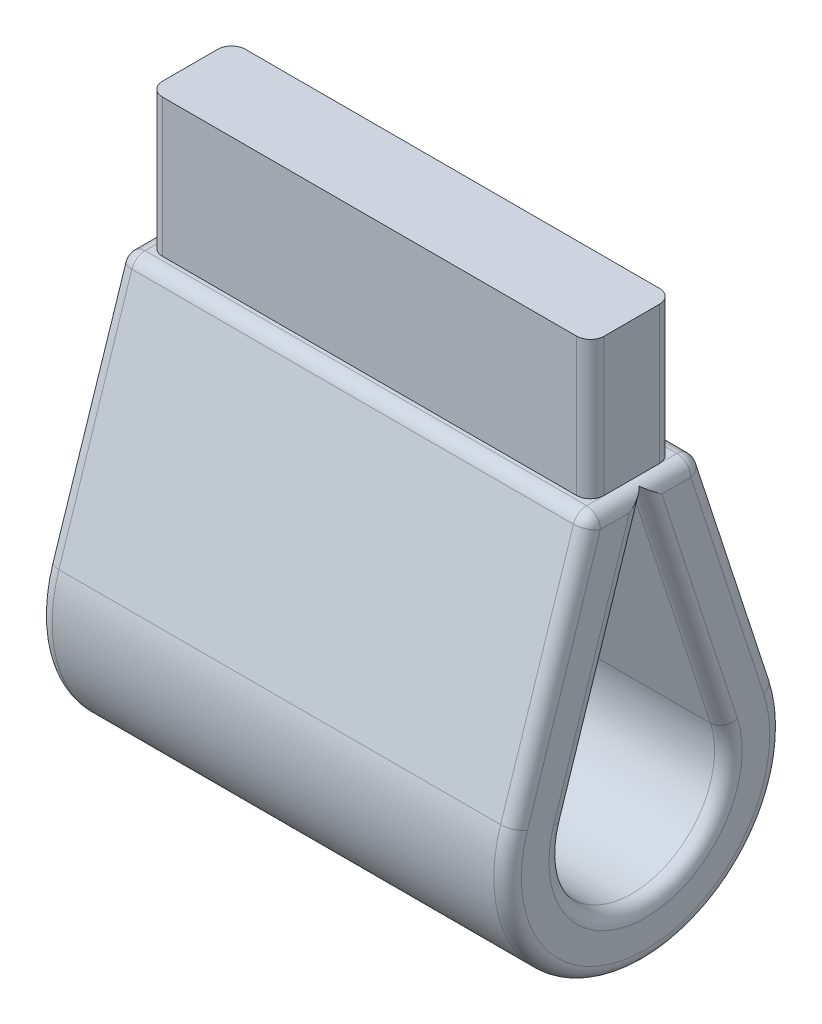
ISO-10303-21;
HEADER;
FILE_DESCRIPTION(('STEP AP214'),'2;1');
FILE_NAME('part.step','',(''),(''),'','','');
FILE_SCHEMA(('AUTOMOTIVE_DESIGN { 1 0 10303 214 1 1 1 1 }'));
ENDSEC;
DATA;
#1=APPLICATION_CONTEXT('core data for automotive mechanical design processes');
#2=APPLICATION_PROTOCOL_DEFINITION('international standard','automotive_design',2000,#1);
#3=PRODUCT_CONTEXT('',#1,'mechanical');
#4=PRODUCT('Part','Part','',(#3));
#5=PRODUCT_RELATED_PRODUCT_CATEGORY('part','',(#4));
#6=PRODUCT_DEFINITION_FORMATION('','',#4);
#7=PRODUCT_DEFINITION_CONTEXT('part definition',#1,'design');
#8=PRODUCT_DEFINITION('design','',#6,#7);
#9=PRODUCT_DEFINITION_SHAPE('','',#8);
#10=(LENGTH_UNIT() NAMED_UNIT(*) SI_UNIT(.MILLI.,.METRE.));
#11=(NAMED_UNIT(*) PLANE_ANGLE_UNIT() SI_UNIT($,.RADIAN.));
#12=(NAMED_UNIT(*) SI_UNIT($,.STERADIAN.) SOLID_ANGLE_UNIT());
#13=UNCERTAINTY_MEASURE_WITH_UNIT(LENGTH_MEASURE(1.E-05),#10,'distance_accuracy_value','');
#14=(GEOMETRIC_REPRESENTATION_CONTEXT(3) GLOBAL_UNCERTAINTY_ASSIGNED_CONTEXT((#13)) GLOBAL_UNIT_ASSIGNED_CONTEXT((#10,
#11,#12)) REPRESENTATION_CONTEXT('',''));
#15=CARTESIAN_POINT('',(0.,0.,0.));
#16=DIRECTION('',(0.,0.,1.));
#17=DIRECTION('',(1.,0.,0.));
#18=AXIS2_PLACEMENT_3D('',#15,#16,#17);
#19=CARTESIAN_POINT('',(0.,20.,0.));
#20=DIRECTION('',(0.,1.,0.));
#21=DIRECTION('',(0.,0.,1.));
#22=AXIS2_PLACEMENT_3D('',#19,#20,#21);
#23=PLANE('',#22);
#24=DIRECTION('',(-1.,0.,0.));
#25=VECTOR('',#24,1.);
#26=CARTESIAN_POINT('',(33.,20.,-3.));
#27=LINE('',#26,#25);
#28=CARTESIAN_POINT('',(32.,20.,-3.));
#29=VERTEX_POINT('',#28);
#30=CARTESIAN_POINT('',(2.,20.,-3.));
#31=VERTEX_POINT('',#30);
#32=EDGE_CURVE('E420',#29,#31,#27,.T.);
#33=ORIENTED_EDGE('',*,*,#32,.F.);
#34=CARTESIAN_POINT('',(32.,20.,-2.));
#35=DIRECTION('',(0.,1.,0.));
#36=DIRECTION('',(0.,0.,1.));
#37=AXIS2_PLACEMENT_3D('',#34,#35,#36);
#38=CIRCLE('',#37,1.);
#39=CARTESIAN_POINT('',(33.,20.,-2.));
#40=VERTEX_POINT('',#39);
#41=EDGE_CURVE('E43',#29,#40,#38,.F.);
#42=ORIENTED_EDGE('',*,*,#41,.T.);
#43=DIRECTION('',(0.,0.,-1.));
#44=VECTOR('',#43,1.);
#45=CARTESIAN_POINT('',(33.,20.,0.));
#46=LINE('',#45,#44);
#47=CARTESIAN_POINT('',(33.,20.,-3.27412037217896));
#48=VERTEX_POINT('',#47);
#49=EDGE_CURVE('E50',#40,#48,#46,.T.);
#50=ORIENTED_EDGE('',*,*,#49,.T.);
#51=DIRECTION('',(-1.,0.,0.));
#52=VECTOR('',#51,1.);
#53=CARTESIAN_POINT('',(0.,20.,-3.27412037217896));
#54=LINE('',#53,#52);
#55=CARTESIAN_POINT('',(1.,20.,-3.27412037217896));
#56=VERTEX_POINT('',#55);
#57=EDGE_CURVE('E304',#48,#56,#54,.T.);
#58=ORIENTED_EDGE('',*,*,#57,.T.);
#59=DIRECTION('',(0.,0.,1.));
#60=VECTOR('',#59,1.);
#61=CARTESIAN_POINT('',(1.,20.,4.));
#62=LINE('',#61,#60);
#63=CARTESIAN_POINT('',(1.,20.,-2.));
#64=VERTEX_POINT('',#63);
#65=EDGE_CURVE('E302',#56,#64,#62,.T.);
#66=ORIENTED_EDGE('',*,*,#65,.T.);
#67=CARTESIAN_POINT('',(2.,20.,-2.));
#68=DIRECTION('',(0.,1.,0.));
#69=DIRECTION('',(0.,0.,1.));
#70=AXIS2_PLACEMENT_3D('',#67,#68,#69);
#71=CIRCLE('',#70,1.);
#72=EDGE_CURVE('E409',#64,#31,#71,.F.);
#73=ORIENTED_EDGE('',*,*,#72,.T.);
#74=EDGE_LOOP('',(#33,#42,#50,#58,#66,#73));
#75=FACE_BOUND('',#74,.T.);
#76=ADVANCED_FACE('F34',(#75),#23,.T.);
#77=CARTESIAN_POINT('',(34.,0.,0.));
#78=DIRECTION('',(1.,0.,0.));
#79=DIRECTION('',(0.,0.,-1.));
#80=AXIS2_PLACEMENT_3D('',#77,#78,#79);
#81=PLANE('',#80);
#82=DIRECTION('',(0.,0.950787924741884,0.309842415051623));
#83=VECTOR('',#82,1.);
#84=CARTESIAN_POINT('',(34.,19.6901575849484,-3.04921207525811));
#85=LINE('',#84,#83);
#86=CARTESIAN_POINT('',(34.,2.78858173546461,-8.55709132267695));
#87=VERTEX_POINT('',#86);
#88=CARTESIAN_POINT('',(34.,19.,-3.27412037217896));
#89=VERTEX_POINT('',#88);
#90=EDGE_CURVE('E255',#87,#89,#85,.T.);
#91=ORIENTED_EDGE('',*,*,#90,.T.);
#92=DIRECTION('',(0.,0.,-1.));
#93=VECTOR('',#92,1.);
#94=CARTESIAN_POINT('',(34.,19.,0.));
#95=LINE('',#94,#93);
#96=CARTESIAN_POINT('',(34.,19.,-1.17060186089481));
#97=VERTEX_POINT('',#96);
#98=EDGE_CURVE('E260',#89,#97,#95,.F.);
#99=ORIENTED_EDGE('',*,*,#98,.T.);
#100=DIRECTION('',(0.,0.950787924741884,0.309842415051623));
#101=VECTOR('',#100,1.);
#102=CARTESIAN_POINT('',(34.,2.16889690536136,-6.65551547319318));
#103=LINE('',#102,#101);
#104=CARTESIAN_POINT('',(34.,2.16889690536136,-6.65551547319319));
#105=VERTEX_POINT('',#104);
#106=EDGE_CURVE('E258',#97,#105,#103,.F.);
#107=ORIENTED_EDGE('',*,*,#106,.T.);
#108=CARTESIAN_POINT('',(34.,0.,0.));
#109=DIRECTION('',(1.,0.,0.));
#110=DIRECTION('',(0.,0.,-1.));
#111=AXIS2_PLACEMENT_3D('',#108,#109,#110);
#112=CIRCLE('',#111,7.);
#113=CARTESIAN_POINT('',(34.,2.16889690536136,6.65551547319318));
#114=VERTEX_POINT('',#113);
#115=EDGE_CURVE('E231',#105,#114,#112,.F.);
#116=ORIENTED_EDGE('',*,*,#115,.T.);
#117=DIRECTION('',(0.,-0.950787924741884,0.309842415051623));
#118=VECTOR('',#117,1.);
#119=CARTESIAN_POINT('',(34.,2.16889690536136,6.65551547319318));
#120=LINE('',#119,#118);
#121=CARTESIAN_POINT('',(34.,19.,1.17060186089481));
#122=VERTEX_POINT('',#121);
#123=EDGE_CURVE('E251',#114,#122,#120,.F.);
#124=ORIENTED_EDGE('',*,*,#123,.T.);
#125=DIRECTION('',(0.,0.,-1.));
#126=VECTOR('',#125,1.);
#127=CARTESIAN_POINT('',(34.,19.,0.));
#128=LINE('',#127,#126);
#129=CARTESIAN_POINT('',(34.,19.,3.27412037217896));
#130=VERTEX_POINT('',#129);
#131=EDGE_CURVE('E244',#122,#130,#128,.F.);
#132=ORIENTED_EDGE('',*,*,#131,.T.);
#133=DIRECTION('',(0.,-0.950787924741884,0.309842415051623));
#134=VECTOR('',#133,1.);
#135=CARTESIAN_POINT('',(34.,2.78858173546461,8.55709132267695));
#136=LINE('',#135,#134);
#137=CARTESIAN_POINT('',(34.,2.78858173546461,8.55709132267695));
#138=VERTEX_POINT('',#137);
#139=EDGE_CURVE('E242',#130,#138,#136,.T.);
#140=ORIENTED_EDGE('',*,*,#139,.T.);
#141=CARTESIAN_POINT('',(34.,0.,0.));
#142=DIRECTION('',(1.,0.,0.));
#143=DIRECTION('',(0.,0.,-1.));
#144=AXIS2_PLACEMENT_3D('',#141,#142,#143);
#145=CIRCLE('',#144,9.);
#146=EDGE_CURVE('E253',#138,#87,#145,.T.);
#147=ORIENTED_EDGE('',*,*,#146,.T.);
#148=EDGE_LOOP('',(#91,#99,#107,#116,#124,#132,#140,#147));
#149=FACE_BOUND('',#148,.T.);
#150=ADVANCED_FACE('F566',(#149),#81,.T.);
#151=CARTESIAN_POINT('',(0.,0.,0.));
#152=DIRECTION('',(1.,0.,0.));
#153=DIRECTION('',(0.,0.,-1.));
#154=AXIS2_PLACEMENT_3D('',#151,#152,#153);
#155=PLANE('',#154);
#156=DIRECTION('',(0.,-0.950787924741884,0.309842415051623));
#157=VECTOR('',#156,1.);
#158=CARTESIAN_POINT('',(0.,2.16889690536136,6.65551547319318));
#159=LINE('',#158,#157);
#160=CARTESIAN_POINT('',(0.,19.,1.17060186089481));
#161=VERTEX_POINT('',#160);
#162=CARTESIAN_POINT('',(0.,2.16889690536136,6.65551547319318));
#163=VERTEX_POINT('',#162);
#164=EDGE_CURVE('E281',#161,#163,#159,.T.);
#165=ORIENTED_EDGE('',*,*,#164,.T.);
#166=CARTESIAN_POINT('',(0.,0.,0.));
#167=DIRECTION('',(1.,0.,0.));
#168=DIRECTION('',(0.,0.,-1.));
#169=AXIS2_PLACEMENT_3D('',#166,#167,#168);
#170=CIRCLE('',#169,7.);
#171=CARTESIAN_POINT('',(0.,2.16889690536136,-6.65551547319318));
#172=VERTEX_POINT('',#171);
#173=EDGE_CURVE('E288',#163,#172,#170,.T.);
#174=ORIENTED_EDGE('',*,*,#173,.T.);
#175=DIRECTION('',(0.,0.950787924741884,0.309842415051623));
#176=VECTOR('',#175,1.);
#177=CARTESIAN_POINT('',(0.,19.674524939232,-0.950787924741882));
#178=LINE('',#177,#176);
#179=CARTESIAN_POINT('',(0.,19.,-1.17060186089481));
#180=VERTEX_POINT('',#179);
#181=EDGE_CURVE('E286',#172,#180,#178,.T.);
#182=ORIENTED_EDGE('',*,*,#181,.T.);
#183=DIRECTION('',(0.,0.,1.));
#184=VECTOR('',#183,1.);
#185=CARTESIAN_POINT('',(0.,19.,-4.));
#186=LINE('',#185,#184);
#187=CARTESIAN_POINT('',(0.,19.,-3.27412037217896));
#188=VERTEX_POINT('',#187);
#189=EDGE_CURVE('E284',#180,#188,#186,.F.);
#190=ORIENTED_EDGE('',*,*,#189,.T.);
#191=DIRECTION('',(0.,0.950787924741884,0.309842415051623));
#192=VECTOR('',#191,1.);
#193=CARTESIAN_POINT('',(0.,2.78858173546461,-8.55709132267695));
#194=LINE('',#193,#192);
#195=CARTESIAN_POINT('',(0.,2.78858173546461,-8.55709132267695));
#196=VERTEX_POINT('',#195);
#197=EDGE_CURVE('E279',#188,#196,#194,.F.);
#198=ORIENTED_EDGE('',*,*,#197,.T.);
#199=CARTESIAN_POINT('',(0.,0.,0.));
#200=DIRECTION('',(1.,0.,0.));
#201=DIRECTION('',(0.,0.,-1.));
#202=AXIS2_PLACEMENT_3D('',#199,#200,#201);
#203=CIRCLE('',#202,9.);
#204=CARTESIAN_POINT('',(0.,2.78858173546461,8.55709132267695));
#205=VERTEX_POINT('',#204);
#206=EDGE_CURVE('E277',#196,#205,#203,.F.);
#207=ORIENTED_EDGE('',*,*,#206,.T.);
#208=DIRECTION('',(0.,-0.950787924741884,0.309842415051623));
#209=VECTOR('',#208,1.);
#210=CARTESIAN_POINT('',(0.,2.78858173546461,8.55709132267695));
#211=LINE('',#210,#209);
#212=CARTESIAN_POINT('',(0.,19.,3.27412037217896));
#213=VERTEX_POINT('',#212);
#214=EDGE_CURVE('E273',#205,#213,#211,.F.);
#215=ORIENTED_EDGE('',*,*,#214,.T.);
#216=DIRECTION('',(0.,0.,1.));
#217=VECTOR('',#216,1.);
#218=CARTESIAN_POINT('',(0.,19.,-4.));
#219=LINE('',#218,#217);
#220=EDGE_CURVE('E275',#213,#161,#219,.F.);
#221=ORIENTED_EDGE('',*,*,#220,.T.);
#222=EDGE_LOOP('',(#165,#174,#182,#190,#198,#207,#215,#221));
#223=FACE_BOUND('',#222,.T.);
#224=ADVANCED_FACE('F518',(#223),#155,.F.);
#225=CARTESIAN_POINT('',(34.,0.,0.));
#226=DIRECTION('',(-1.,0.,0.));
#227=DIRECTION('',(0.,0.,1.));
#228=AXIS2_PLACEMENT_3D('',#225,#226,#227);
#229=CYLINDRICAL_SURFACE('',#228,10.);
#230=DIRECTION('',(-1.,0.,0.));
#231=VECTOR('',#230,1.);
#232=CARTESIAN_POINT('',(34.,3.09842415051623,-9.50787924741883));
#233=LINE('',#232,#231);
#234=CARTESIAN_POINT('',(33.,3.09842415051623,-9.50787924741883));
#235=VERTEX_POINT('',#234);
#236=CARTESIAN_POINT('',(1.,3.09842415051623,-9.50787924741883));
#237=VERTEX_POINT('',#236);
#238=EDGE_CURVE('E246',#235,#237,#233,.T.);
#239=ORIENTED_EDGE('',*,*,#238,.F.);
#240=CARTESIAN_POINT('',(33.,0.,0.));
#241=DIRECTION('',(1.,0.,0.));
#242=DIRECTION('',(0.,0.,-1.));
#243=AXIS2_PLACEMENT_3D('',#240,#241,#242);
#244=CIRCLE('',#243,10.);
#245=CARTESIAN_POINT('',(33.,3.09842415051623,9.50787924741883));
#246=VERTEX_POINT('',#245);
#247=EDGE_CURVE('E271',#235,#246,#244,.F.);
#248=ORIENTED_EDGE('',*,*,#247,.T.);
#249=DIRECTION('',(-1.,0.,0.));
#250=VECTOR('',#249,1.);
#251=CARTESIAN_POINT('',(34.,3.09842415051623,9.50787924741883));
#252=LINE('',#251,#250);
#253=CARTESIAN_POINT('',(1.,3.09842415051623,9.50787924741883));
#254=VERTEX_POINT('',#253);
#255=EDGE_CURVE('E225',#246,#254,#252,.T.);
#256=ORIENTED_EDGE('',*,*,#255,.T.);
#257=CARTESIAN_POINT('',(1.,0.,0.));
#258=DIRECTION('',(1.,0.,0.));
#259=DIRECTION('',(0.,0.,-1.));
#260=AXIS2_PLACEMENT_3D('',#257,#258,#259);
#261=CIRCLE('',#260,10.);
#262=EDGE_CURVE('E269',#254,#237,#261,.T.);
#263=ORIENTED_EDGE('',*,*,#262,.T.);
#264=EDGE_LOOP('',(#239,#248,#256,#263));
#265=FACE_BOUND('',#264,.T.);
#266=ADVANCED_FACE('F485',(#265),#229,.T.);
#267=CARTESIAN_POINT('',(34.,20.,-4.));
#268=DIRECTION('',(0.,-0.309842415051623,0.950787924741884));
#269=DIRECTION('',(0.,-0.950787924741884,-0.309842415051623));
#270=AXIS2_PLACEMENT_3D('',#267,#268,#269);
#271=PLANE('',#270);
#272=DIRECTION('',(-1.,0.,0.));
#273=VECTOR('',#272,1.);
#274=CARTESIAN_POINT('',(34.,19.3098424150516,-4.22490829692085));
#275=LINE('',#274,#273);
#276=CARTESIAN_POINT('',(1.,19.3098424150516,-4.22490829692085));
#277=VERTEX_POINT('',#276);
#278=CARTESIAN_POINT('',(33.,19.3098424150516,-4.22490829692085));
#279=VERTEX_POINT('',#278);
#280=EDGE_CURVE('E214',#277,#279,#275,.F.);
#281=ORIENTED_EDGE('',*,*,#280,.T.);
#282=DIRECTION('',(0.,0.950787924741884,0.309842415051623));
#283=VECTOR('',#282,1.);
#284=CARTESIAN_POINT('',(33.,3.09842415051623,-9.50787924741883));
#285=LINE('',#284,#283);
#286=EDGE_CURVE('E266',#279,#235,#285,.F.);
#287=ORIENTED_EDGE('',*,*,#286,.T.);
#288=ORIENTED_EDGE('',*,*,#238,.T.);
#289=DIRECTION('',(0.,0.950787924741884,0.309842415051623));
#290=VECTOR('',#289,1.);
#291=CARTESIAN_POINT('',(1.,20.,-4.));
#292=LINE('',#291,#290);
#293=EDGE_CURVE('E264',#237,#277,#292,.T.);
#294=ORIENTED_EDGE('',*,*,#293,.T.);
#295=EDGE_LOOP('',(#281,#287,#288,#294));
#296=FACE_BOUND('',#295,.T.);
#297=ADVANCED_FACE('F451',(#296),#271,.F.);
#298=CARTESIAN_POINT('',(34.,3.09842415051623,9.50787924741883));
#299=DIRECTION('',(0.,-0.309842415051623,-0.950787924741884));
#300=DIRECTION('',(0.,0.950787924741884,-0.309842415051623));
#301=AXIS2_PLACEMENT_3D('',#298,#299,#300);
#302=PLANE('',#301);
#303=ORIENTED_EDGE('',*,*,#255,.F.);
#304=DIRECTION('',(0.,-0.950787924741884,0.309842415051623));
#305=VECTOR('',#304,1.);
#306=CARTESIAN_POINT('',(33.,20.,4.));
#307=LINE('',#306,#305);
#308=CARTESIAN_POINT('',(33.,19.3098424150516,4.22490829692085));
#309=VERTEX_POINT('',#308);
#310=EDGE_CURVE('E311',#246,#309,#307,.F.);
#311=ORIENTED_EDGE('',*,*,#310,.T.);
#312=DIRECTION('',(-1.,0.,0.));
#313=VECTOR('',#312,1.);
#314=CARTESIAN_POINT('',(0.,19.3098424150516,4.22490829692085));
#315=LINE('',#314,#313);
#316=CARTESIAN_POINT('',(1.,19.3098424150516,4.22490829692085));
#317=VERTEX_POINT('',#316);
#318=EDGE_CURVE('E309',#309,#317,#315,.T.);
#319=ORIENTED_EDGE('',*,*,#318,.T.);
#320=DIRECTION('',(0.,-0.950787924741884,0.309842415051623));
#321=VECTOR('',#320,1.);
#322=CARTESIAN_POINT('',(1.,3.09842415051623,9.50787924741883));
#323=LINE('',#322,#321);
#324=EDGE_CURVE('E307',#317,#254,#323,.T.);
#325=ORIENTED_EDGE('',*,*,#324,.T.);
#326=EDGE_LOOP('',(#303,#311,#319,#325));
#327=FACE_BOUND('',#326,.T.);
#328=ADVANCED_FACE('F487',(#327),#302,.F.);
#329=CARTESIAN_POINT('',(34.,0.,0.));
#330=DIRECTION('',(-1.,0.,0.));
#331=DIRECTION('',(0.,0.,1.));
#332=AXIS2_PLACEMENT_3D('',#329,#330,#331);
#333=CYLINDRICAL_SURFACE('',#332,6.);
#334=DIRECTION('',(-1.,0.,0.));
#335=VECTOR('',#334,1.);
#336=CARTESIAN_POINT('',(34.,1.85905449030974,5.7047275484513));
#337=LINE('',#336,#335);
#338=CARTESIAN_POINT('',(33.,1.85905449030974,5.7047275484513));
#339=VERTEX_POINT('',#338);
#340=CARTESIAN_POINT('',(1.,1.85905449030974,5.7047275484513));
#341=VERTEX_POINT('',#340);
#342=EDGE_CURVE('E209',#339,#341,#337,.T.);
#343=ORIENTED_EDGE('',*,*,#342,.F.);
#344=CARTESIAN_POINT('',(33.,0.,0.));
#345=DIRECTION('',(1.,0.,0.));
#346=DIRECTION('',(0.,0.,-1.));
#347=AXIS2_PLACEMENT_3D('',#344,#345,#346);
#348=CIRCLE('',#347,6.);
#349=CARTESIAN_POINT('',(33.,1.85905449030974,-5.7047275484513));
#350=VERTEX_POINT('',#349);
#351=EDGE_CURVE('E203',#339,#350,#348,.T.);
#352=ORIENTED_EDGE('',*,*,#351,.T.);
#353=DIRECTION('',(-1.,0.,0.));
#354=VECTOR('',#353,1.);
#355=CARTESIAN_POINT('',(34.,1.85905449030974,-5.7047275484513));
#356=LINE('',#355,#354);
#357=CARTESIAN_POINT('',(1.,1.85905449030974,-5.7047275484513));
#358=VERTEX_POINT('',#357);
#359=EDGE_CURVE('E206',#350,#358,#356,.T.);
#360=ORIENTED_EDGE('',*,*,#359,.T.);
#361=CARTESIAN_POINT('',(1.,0.,0.));
#362=DIRECTION('',(1.,0.,0.));
#363=DIRECTION('',(0.,0.,-1.));
#364=AXIS2_PLACEMENT_3D('',#361,#362,#363);
#365=CIRCLE('',#364,6.);
#366=EDGE_CURVE('E215',#358,#341,#365,.F.);
#367=ORIENTED_EDGE('',*,*,#366,.T.);
#368=EDGE_LOOP('',(#343,#352,#360,#367));
#369=FACE_BOUND('',#368,.T.);
#370=ADVANCED_FACE('F205',(#369),#333,.F.);
#371=CARTESIAN_POINT('',(34.,19.3646825241803,0.));
#372=DIRECTION('',(0.,-0.309842415051623,0.950787924741884));
#373=DIRECTION('',(0.,-0.950787924741884,-0.309842415051623));
#374=AXIS2_PLACEMENT_3D('',#371,#372,#373);
#375=PLANE('',#374);
#376=ORIENTED_EDGE('',*,*,#359,.F.);
#377=DIRECTION('',(0.,0.950787924741884,0.309842415051623));
#378=VECTOR('',#377,1.);
#379=CARTESIAN_POINT('',(33.,19.3646825241803,0.));
#380=LINE('',#379,#378);
#381=CARTESIAN_POINT('',(33.,19.3646825241803,0.));
#382=VERTEX_POINT('',#381);
#383=EDGE_CURVE('E222',#350,#382,#380,.T.);
#384=ORIENTED_EDGE('',*,*,#383,.T.);
#385=DIRECTION('',(-1.,0.,0.));
#386=VECTOR('',#385,1.);
#387=CARTESIAN_POINT('',(34.,19.3646825241803,0.));
#388=LINE('',#387,#386);
#389=CARTESIAN_POINT('',(1.,19.3646825241803,0.));
#390=VERTEX_POINT('',#389);
#391=EDGE_CURVE('E226',#382,#390,#388,.T.);
#392=ORIENTED_EDGE('',*,*,#391,.T.);
#393=DIRECTION('',(0.,0.950787924741884,0.309842415051623));
#394=VECTOR('',#393,1.);
#395=CARTESIAN_POINT('',(1.,1.85905449030974,-5.7047275484513));
#396=LINE('',#395,#394);
#397=EDGE_CURVE('E224',#390,#358,#396,.F.);
#398=ORIENTED_EDGE('',*,*,#397,.T.);
#399=EDGE_LOOP('',(#376,#384,#392,#398));
#400=FACE_BOUND('',#399,.T.);
#401=ADVANCED_FACE('F219',(#400),#375,.T.);
#402=CARTESIAN_POINT('',(34.,1.85905449030974,5.7047275484513));
#403=DIRECTION('',(0.,-0.309842415051623,-0.950787924741884));
#404=DIRECTION('',(0.,0.950787924741884,-0.309842415051623));
#405=AXIS2_PLACEMENT_3D('',#402,#403,#404);
#406=PLANE('',#405);
#407=ORIENTED_EDGE('',*,*,#342,.T.);
#408=DIRECTION('',(0.,-0.950787924741884,0.309842415051623));
#409=VECTOR('',#408,1.);
#410=CARTESIAN_POINT('',(1.,19.3646825241803,0.));
#411=LINE('',#410,#409);
#412=EDGE_CURVE('E292',#341,#390,#411,.F.);
#413=ORIENTED_EDGE('',*,*,#412,.T.);
#414=ORIENTED_EDGE('',*,*,#391,.F.);
#415=DIRECTION('',(0.,-0.950787924741884,0.309842415051623));
#416=VECTOR('',#415,1.);
#417=CARTESIAN_POINT('',(33.,1.85905449030974,5.7047275484513));
#418=LINE('',#417,#416);
#419=EDGE_CURVE('E290',#382,#339,#418,.T.);
#420=ORIENTED_EDGE('',*,*,#419,.T.);
#421=EDGE_LOOP('',(#407,#413,#414,#420));
#422=FACE_BOUND('',#421,.T.);
#423=ADVANCED_FACE('F592',(#422),#406,.T.);
#424=DIRECTION('',(-1.,0.,0.));
#425=VECTOR('',#424,1.);
#426=CARTESIAN_POINT('',(34.,20.,3.27412037217896));
#427=LINE('',#426,#425);
#428=CARTESIAN_POINT('',(1.,20.,3.27412037217896));
#429=VERTEX_POINT('',#428);
#430=CARTESIAN_POINT('',(33.,20.,3.27412037217896));
#431=VERTEX_POINT('',#430);
#432=EDGE_CURVE('E297',#429,#431,#427,.F.);
#433=ORIENTED_EDGE('',*,*,#432,.T.);
#434=DIRECTION('',(0.,0.,-1.));
#435=VECTOR('',#434,1.);
#436=CARTESIAN_POINT('',(33.,20.,0.));
#437=LINE('',#436,#435);
#438=CARTESIAN_POINT('',(33.,20.,2.));
#439=VERTEX_POINT('',#438);
#440=EDGE_CURVE('E299',#431,#439,#437,.T.);
#441=ORIENTED_EDGE('',*,*,#440,.T.);
#442=CARTESIAN_POINT('',(32.,20.,2.));
#443=DIRECTION('',(0.,1.,0.));
#444=DIRECTION('',(0.,0.,1.));
#445=AXIS2_PLACEMENT_3D('',#442,#443,#444);
#446=CIRCLE('',#445,1.);
#447=CARTESIAN_POINT('',(32.,20.,3.));
#448=VERTEX_POINT('',#447);
#449=EDGE_CURVE('E11',#439,#448,#446,.F.);
#450=ORIENTED_EDGE('',*,*,#449,.T.);
#451=DIRECTION('',(1.,0.,0.));
#452=VECTOR('',#451,1.);
#453=CARTESIAN_POINT('',(1.,20.,3.));
#454=LINE('',#453,#452);
#455=CARTESIAN_POINT('',(2.,20.,3.));
#456=VERTEX_POINT('',#455);
#457=EDGE_CURVE('E548',#456,#448,#454,.T.);
#458=ORIENTED_EDGE('',*,*,#457,.F.);
#459=CARTESIAN_POINT('',(2.,20.,2.));
#460=DIRECTION('',(0.,1.,0.));
#461=DIRECTION('',(0.,0.,1.));
#462=AXIS2_PLACEMENT_3D('',#459,#460,#461);
#463=CIRCLE('',#462,1.);
#464=CARTESIAN_POINT('',(1.,20.,2.));
#465=VERTEX_POINT('',#464);
#466=EDGE_CURVE('E411',#456,#465,#463,.F.);
#467=ORIENTED_EDGE('',*,*,#466,.T.);
#468=DIRECTION('',(0.,0.,1.));
#469=VECTOR('',#468,1.);
#470=CARTESIAN_POINT('',(1.,20.,4.));
#471=LINE('',#470,#469);
#472=EDGE_CURVE('E295',#465,#429,#471,.T.);
#473=ORIENTED_EDGE('',*,*,#472,.T.);
#474=EDGE_LOOP('',(#433,#441,#450,#458,#467,#473));
#475=FACE_BOUND('',#474,.T.);
#476=ADVANCED_FACE('F505',(#475),#23,.T.);
#477=CARTESIAN_POINT('',(33.,20.,-3.));
#478=DIRECTION('',(0.,0.,-1.));
#479=DIRECTION('',(-1.,0.,0.));
#480=AXIS2_PLACEMENT_3D('',#477,#478,#479);
#481=PLANE('',#480);
#482=ORIENTED_EDGE('',*,*,#32,.T.);
#483=DIRECTION('',(0.,1.,0.));
#484=VECTOR('',#483,1.);
#485=CARTESIAN_POINT('',(2.,20.,-3.));
#486=LINE('',#485,#484);
#487=CARTESIAN_POINT('',(2.,30.,-3.));
#488=VERTEX_POINT('',#487);
#489=EDGE_CURVE('E381',#31,#488,#486,.T.);
#490=ORIENTED_EDGE('',*,*,#489,.T.);
#491=DIRECTION('',(-1.,0.,0.));
#492=VECTOR('',#491,1.);
#493=CARTESIAN_POINT('',(33.,30.,-3.));
#494=LINE('',#493,#492);
#495=CARTESIAN_POINT('',(32.,30.,-3.));
#496=VERTEX_POINT('',#495);
#497=EDGE_CURVE('E379',#496,#488,#494,.T.);
#498=ORIENTED_EDGE('',*,*,#497,.F.);
#499=DIRECTION('',(0.,1.,0.));
#500=VECTOR('',#499,1.);
#501=CARTESIAN_POINT('',(32.,20.,-3.));
#502=LINE('',#501,#500);
#503=EDGE_CURVE('E313',#496,#29,#502,.F.);
#504=ORIENTED_EDGE('',*,*,#503,.T.);
#505=EDGE_LOOP('',(#482,#490,#498,#504));
#506=FACE_BOUND('',#505,.T.);
#507=ADVANCED_FACE('F544',(#506),#481,.T.);
#508=CARTESIAN_POINT('',(33.,20.,3.));
#509=DIRECTION('',(1.,0.,0.));
#510=DIRECTION('',(0.,0.,-1.));
#511=AXIS2_PLACEMENT_3D('',#508,#509,#510);
#512=PLANE('',#511);
#513=DIRECTION('',(0.,0.,-1.));
#514=VECTOR('',#513,1.);
#515=CARTESIAN_POINT('',(33.,20.,3.));
#516=LINE('',#515,#514);
#517=EDGE_CURVE('E430',#439,#40,#516,.T.);
#518=ORIENTED_EDGE('',*,*,#517,.T.);
#519=DIRECTION('',(0.,1.,0.));
#520=VECTOR('',#519,1.);
#521=CARTESIAN_POINT('',(33.,20.,-2.));
#522=LINE('',#521,#520);
#523=CARTESIAN_POINT('',(33.,30.,-2.));
#524=VERTEX_POINT('',#523);
#525=EDGE_CURVE('E406',#40,#524,#522,.T.);
#526=ORIENTED_EDGE('',*,*,#525,.T.);
#527=DIRECTION('',(0.,0.,-1.));
#528=VECTOR('',#527,1.);
#529=CARTESIAN_POINT('',(33.,30.,3.));
#530=LINE('',#529,#528);
#531=CARTESIAN_POINT('',(33.,30.,2.));
#532=VERTEX_POINT('',#531);
#533=EDGE_CURVE('E428',#532,#524,#530,.T.);
#534=ORIENTED_EDGE('',*,*,#533,.F.);
#535=DIRECTION('',(0.,1.,0.));
#536=VECTOR('',#535,1.);
#537=CARTESIAN_POINT('',(33.,20.,2.));
#538=LINE('',#537,#536);
#539=EDGE_CURVE('E403',#532,#439,#538,.F.);
#540=ORIENTED_EDGE('',*,*,#539,.T.);
#541=EDGE_LOOP('',(#518,#526,#534,#540));
#542=FACE_BOUND('',#541,.T.);
#543=ADVANCED_FACE('F427',(#542),#512,.T.);
#544=CARTESIAN_POINT('',(1.,20.,3.));
#545=DIRECTION('',(0.,0.,1.));
#546=DIRECTION('',(1.,0.,0.));
#547=AXIS2_PLACEMENT_3D('',#544,#545,#546);
#548=PLANE('',#547);
#549=DIRECTION('',(1.,0.,0.));
#550=VECTOR('',#549,1.);
#551=CARTESIAN_POINT('',(1.,30.,3.));
#552=LINE('',#551,#550);
#553=CARTESIAN_POINT('',(2.,30.,3.));
#554=VERTEX_POINT('',#553);
#555=CARTESIAN_POINT('',(32.,30.,3.));
#556=VERTEX_POINT('',#555);
#557=EDGE_CURVE('E436',#554,#556,#552,.T.);
#558=ORIENTED_EDGE('',*,*,#557,.F.);
#559=DIRECTION('',(0.,1.,0.));
#560=VECTOR('',#559,1.);
#561=CARTESIAN_POINT('',(2.,20.,3.));
#562=LINE('',#561,#560);
#563=EDGE_CURVE('E401',#554,#456,#562,.F.);
#564=ORIENTED_EDGE('',*,*,#563,.T.);
#565=ORIENTED_EDGE('',*,*,#457,.T.);
#566=DIRECTION('',(0.,1.,0.));
#567=VECTOR('',#566,1.);
#568=CARTESIAN_POINT('',(32.,20.,3.));
#569=LINE('',#568,#567);
#570=EDGE_CURVE('E398',#448,#556,#569,.T.);
#571=ORIENTED_EDGE('',*,*,#570,.T.);
#572=EDGE_LOOP('',(#558,#564,#565,#571));
#573=FACE_BOUND('',#572,.T.);
#574=ADVANCED_FACE('F554',(#573),#548,.T.);
#575=CARTESIAN_POINT('',(1.,20.,-3.));
#576=DIRECTION('',(-1.,0.,0.));
#577=DIRECTION('',(0.,0.,1.));
#578=AXIS2_PLACEMENT_3D('',#575,#576,#577);
#579=PLANE('',#578);
#580=DIRECTION('',(0.,0.,1.));
#581=VECTOR('',#580,1.);
#582=CARTESIAN_POINT('',(1.,30.,-3.));
#583=LINE('',#582,#581);
#584=CARTESIAN_POINT('',(1.,30.,-2.));
#585=VERTEX_POINT('',#584);
#586=CARTESIAN_POINT('',(1.,30.,2.));
#587=VERTEX_POINT('',#586);
#588=EDGE_CURVE('E440',#585,#587,#583,.T.);
#589=ORIENTED_EDGE('',*,*,#588,.F.);
#590=DIRECTION('',(0.,1.,0.));
#591=VECTOR('',#590,1.);
#592=CARTESIAN_POINT('',(1.,20.,-2.));
#593=LINE('',#592,#591);
#594=EDGE_CURVE('E395',#585,#64,#593,.F.);
#595=ORIENTED_EDGE('',*,*,#594,.T.);
#596=DIRECTION('',(0.,0.,1.));
#597=VECTOR('',#596,1.);
#598=CARTESIAN_POINT('',(1.,20.,-3.));
#599=LINE('',#598,#597);
#600=EDGE_CURVE('E438',#64,#465,#599,.T.);
#601=ORIENTED_EDGE('',*,*,#600,.T.);
#602=DIRECTION('',(0.,1.,0.));
#603=VECTOR('',#602,1.);
#604=CARTESIAN_POINT('',(1.,20.,2.));
#605=LINE('',#604,#603);
#606=EDGE_CURVE('E392',#465,#587,#605,.T.);
#607=ORIENTED_EDGE('',*,*,#606,.T.);
#608=EDGE_LOOP('',(#589,#595,#601,#607));
#609=FACE_BOUND('',#608,.T.);
#610=ADVANCED_FACE('F538',(#609),#579,.T.);
#611=CARTESIAN_POINT('',(34.,30.,4.));
#612=DIRECTION('',(0.,-1.,0.));
#613=DIRECTION('',(0.,0.,-1.));
#614=AXIS2_PLACEMENT_3D('',#611,#612,#613);
#615=PLANE('',#614);
#616=ORIENTED_EDGE('',*,*,#497,.T.);
#617=CARTESIAN_POINT('',(2.,30.,-2.));
#618=DIRECTION('',(0.,-1.,0.));
#619=DIRECTION('',(0.,0.,-1.));
#620=AXIS2_PLACEMENT_3D('',#617,#618,#619);
#621=CIRCLE('',#620,1.);
#622=EDGE_CURVE('E390',#488,#585,#621,.F.);
#623=ORIENTED_EDGE('',*,*,#622,.T.);
#624=ORIENTED_EDGE('',*,*,#588,.T.);
#625=CARTESIAN_POINT('',(2.,30.,2.));
#626=DIRECTION('',(0.,-1.,0.));
#627=DIRECTION('',(0.,0.,-1.));
#628=AXIS2_PLACEMENT_3D('',#625,#626,#627);
#629=CIRCLE('',#628,1.);
#630=EDGE_CURVE('E388',#587,#554,#629,.F.);
#631=ORIENTED_EDGE('',*,*,#630,.T.);
#632=ORIENTED_EDGE('',*,*,#557,.T.);
#633=CARTESIAN_POINT('',(32.,30.,2.));
#634=DIRECTION('',(0.,-1.,0.));
#635=DIRECTION('',(0.,0.,-1.));
#636=AXIS2_PLACEMENT_3D('',#633,#634,#635);
#637=CIRCLE('',#636,1.);
#638=EDGE_CURVE('E384',#556,#532,#637,.F.);
#639=ORIENTED_EDGE('',*,*,#638,.T.);
#640=ORIENTED_EDGE('',*,*,#533,.T.);
#641=CARTESIAN_POINT('',(32.,30.,-2.));
#642=DIRECTION('',(0.,-1.,0.));
#643=DIRECTION('',(0.,0.,-1.));
#644=AXIS2_PLACEMENT_3D('',#641,#642,#643);
#645=CIRCLE('',#644,1.);
#646=EDGE_CURVE('E386',#524,#496,#645,.F.);
#647=ORIENTED_EDGE('',*,*,#646,.T.);
#648=EDGE_LOOP('',(#616,#623,#624,#631,#632,#639,#640,#647));
#649=FACE_BOUND('',#648,.T.);
#650=ADVANCED_FACE('F433',(#649),#615,.F.);
#651=CARTESIAN_POINT('',(1.,0.,0.));
#652=DIRECTION('',(1.,0.,0.));
#653=DIRECTION('',(0.,0.,-1.));
#654=AXIS2_PLACEMENT_3D('',#651,#652,#653);
#655=TOROIDAL_SURFACE('',#654,7.,1.);
#656=CARTESIAN_POINT('',(1.,2.16889690536136,-6.65551547319319));
#657=DIRECTION('',(0.,0.950787924741884,0.309842415051623));
#658=DIRECTION('',(0.,-0.309842415051623,0.950787924741884));
#659=AXIS2_PLACEMENT_3D('',#656,#657,#658);
#660=CIRCLE('',#659,1.);
#661=EDGE_CURVE('E372',#172,#358,#660,.T.);
#662=ORIENTED_EDGE('',*,*,#661,.F.);
#663=ORIENTED_EDGE('',*,*,#173,.F.);
#664=CARTESIAN_POINT('',(1.,2.16889690536136,6.65551547319318));
#665=DIRECTION('',(0.,0.950787924741884,-0.309842415051623));
#666=DIRECTION('',(0.,0.309842415051623,0.950787924741884));
#667=AXIS2_PLACEMENT_3D('',#664,#665,#666);
#668=CIRCLE('',#667,1.);
#669=EDGE_CURVE('E377',#341,#163,#668,.T.);
#670=ORIENTED_EDGE('',*,*,#669,.F.);
#671=ORIENTED_EDGE('',*,*,#366,.F.);
#672=EDGE_LOOP('',(#662,#663,#670,#671));
#673=FACE_BOUND('',#672,.T.);
#674=ADVANCED_FACE('F527',(#673),#655,.T.);
#675=CARTESIAN_POINT('',(1.,2.16889690536136,6.65551547319318));
#676=DIRECTION('',(0.,0.950787924741884,-0.309842415051623));
#677=DIRECTION('',(0.,0.309842415051623,0.950787924741884));
#678=AXIS2_PLACEMENT_3D('',#675,#676,#677);
#679=CYLINDRICAL_SURFACE('',#678,1.);
#680=CARTESIAN_POINT('',(1.,22.5921296115437,0.));
#681=DIRECTION('',(0.,0.,-1.));
#682=DIRECTION('',(0.,1.,0.));
#683=AXIS2_PLACEMENT_3D('',#680,#681,#682);
#684=ELLIPSE('',#683,3.22744708736339,1.);
#685=CARTESIAN_POINT('',(0.472759403994257,19.8497160431129,0.));
#686=VERTEX_POINT('',#685);
#687=EDGE_CURVE('E375',#390,#686,#684,.T.);
#688=ORIENTED_EDGE('',*,*,#687,.F.);
#689=ORIENTED_EDGE('',*,*,#412,.F.);
#690=ORIENTED_EDGE('',*,*,#669,.T.);
#691=ORIENTED_EDGE('',*,*,#164,.F.);
#692=CARTESIAN_POINT('',(1.,19.,1.17060186089481));
#693=DIRECTION('',(0.,0.809272023194804,0.587434075002624));
#694=DIRECTION('',(0.,0.587434075002624,-0.809272023194804));
#695=AXIS2_PLACEMENT_3D('',#692,#693,#694);
#696=ELLIPSE('',#695,1.70231868145465,1.);
#697=EDGE_CURVE('E366',#686,#161,#696,.T.);
#698=ORIENTED_EDGE('',*,*,#697,.F.);
#699=EDGE_LOOP('',(#688,#689,#690,#691,#698));
#700=FACE_BOUND('',#699,.T.);
#701=ADVANCED_FACE('F521',(#700),#679,.T.);
#702=CARTESIAN_POINT('',(1.,2.16889690536136,-6.65551547319318));
#703=DIRECTION('',(0.,-0.950787924741884,-0.309842415051623));
#704=DIRECTION('',(0.,0.309842415051623,-0.950787924741884));
#705=AXIS2_PLACEMENT_3D('',#702,#703,#704);
#706=CYLINDRICAL_SURFACE('',#705,1.);
#707=ORIENTED_EDGE('',*,*,#397,.F.);
#708=ORIENTED_EDGE('',*,*,#687,.T.);
#709=CARTESIAN_POINT('',(1.,19.,-1.17060186089481));
#710=DIRECTION('',(0.,-0.809272023194804,0.587434075002624));
#711=DIRECTION('',(0.,-0.587434075002624,-0.809272023194804));
#712=AXIS2_PLACEMENT_3D('',#709,#710,#711);
#713=ELLIPSE('',#712,1.70231868145465,1.);
#714=EDGE_CURVE('E363',#180,#686,#713,.F.);
#715=ORIENTED_EDGE('',*,*,#714,.F.);
#716=ORIENTED_EDGE('',*,*,#181,.F.);
#717=ORIENTED_EDGE('',*,*,#661,.T.);
#718=EDGE_LOOP('',(#707,#708,#715,#716,#717));
#719=FACE_BOUND('',#718,.T.);
#720=ADVANCED_FACE('F532',(#719),#706,.T.);
#721=CARTESIAN_POINT('',(1.,0.,0.));
#722=DIRECTION('',(1.,0.,0.));
#723=DIRECTION('',(0.,0.,-1.));
#724=AXIS2_PLACEMENT_3D('',#721,#722,#723);
#725=TOROIDAL_SURFACE('',#724,9.,1.);
#726=CARTESIAN_POINT('',(1.,2.78858173546461,-8.55709132267695));
#727=DIRECTION('',(0.,0.950787924741884,0.309842415051623));
#728=DIRECTION('',(0.,-0.309842415051623,0.950787924741884));
#729=AXIS2_PLACEMENT_3D('',#726,#727,#728);
#730=CIRCLE('',#729,1.);
#731=EDGE_CURVE('E360',#237,#196,#730,.T.);
#732=ORIENTED_EDGE('',*,*,#731,.F.);
#733=ORIENTED_EDGE('',*,*,#262,.F.);
#734=CARTESIAN_POINT('',(1.,2.78858173546461,8.55709132267695));
#735=DIRECTION('',(0.,0.950787924741884,-0.309842415051623));
#736=DIRECTION('',(0.,0.309842415051623,0.950787924741884));
#737=AXIS2_PLACEMENT_3D('',#734,#735,#736);
#738=CIRCLE('',#737,1.);
#739=EDGE_CURVE('E369',#205,#254,#738,.T.);
#740=ORIENTED_EDGE('',*,*,#739,.F.);
#741=ORIENTED_EDGE('',*,*,#206,.F.);
#742=EDGE_LOOP('',(#732,#733,#740,#741));
#743=FACE_BOUND('',#742,.T.);
#744=ADVANCED_FACE('F459',(#743),#725,.T.);
#745=CARTESIAN_POINT('',(1.,2.78858173546461,8.55709132267695));
#746=DIRECTION('',(0.,-0.950787924741884,0.309842415051623));
#747=DIRECTION('',(0.,-0.309842415051623,-0.950787924741884));
#748=AXIS2_PLACEMENT_3D('',#745,#746,#747);
#749=CYLINDRICAL_SURFACE('',#748,1.);
#750=ORIENTED_EDGE('',*,*,#739,.T.);
#751=ORIENTED_EDGE('',*,*,#324,.F.);
#752=CARTESIAN_POINT('',(1.,19.,3.27412037217896));
#753=DIRECTION('',(0.,0.950787924741884,-0.309842415051622));
#754=DIRECTION('',(0.,0.309842415051622,0.950787924741884));
#755=AXIS2_PLACEMENT_3D('',#752,#753,#754);
#756=CIRCLE('',#755,1.);
#757=EDGE_CURVE('E357',#213,#317,#756,.T.);
#758=ORIENTED_EDGE('',*,*,#757,.F.);
#759=ORIENTED_EDGE('',*,*,#214,.F.);
#760=EDGE_LOOP('',(#750,#751,#758,#759));
#761=FACE_BOUND('',#760,.T.);
#762=ADVANCED_FACE('F492',(#761),#749,.T.);
#763=CARTESIAN_POINT('',(1.,19.,0.));
#764=DIRECTION('',(0.,0.,-1.));
#765=DIRECTION('',(-1.,0.,0.));
#766=AXIS2_PLACEMENT_3D('',#763,#764,#765);
#767=CYLINDRICAL_SURFACE('',#766,1.);
#768=ORIENTED_EDGE('',*,*,#697,.T.);
#769=ORIENTED_EDGE('',*,*,#220,.F.);
#770=CARTESIAN_POINT('',(1.,19.,3.27412037217896));
#771=DIRECTION('',(0.,0.,1.));
#772=DIRECTION('',(1.,0.,0.));
#773=AXIS2_PLACEMENT_3D('',#770,#771,#772);
#774=CIRCLE('',#773,1.);
#775=EDGE_CURVE('E354',#429,#213,#774,.T.);
#776=ORIENTED_EDGE('',*,*,#775,.F.);
#777=ORIENTED_EDGE('',*,*,#472,.F.);
#778=ORIENTED_EDGE('',*,*,#600,.F.);
#779=ORIENTED_EDGE('',*,*,#65,.F.);
#780=CARTESIAN_POINT('',(1.,19.,-3.27412037217896));
#781=DIRECTION('',(0.,0.,-1.));
#782=DIRECTION('',(-1.,0.,0.));
#783=AXIS2_PLACEMENT_3D('',#780,#781,#782);
#784=CIRCLE('',#783,1.);
#785=EDGE_CURVE('E351',#188,#56,#784,.T.);
#786=ORIENTED_EDGE('',*,*,#785,.F.);
#787=ORIENTED_EDGE('',*,*,#189,.F.);
#788=ORIENTED_EDGE('',*,*,#714,.T.);
#789=EDGE_LOOP('',(#768,#769,#776,#777,#778,#779,#786,#787,#788));
#790=FACE_BOUND('',#789,.T.);
#791=ADVANCED_FACE('F514',(#790),#767,.T.);
#792=CARTESIAN_POINT('',(1.,19.6901575849484,-3.04921207525812));
#793=DIRECTION('',(0.,0.950787924741884,0.309842415051623));
#794=DIRECTION('',(0.,-0.309842415051623,0.950787924741884));
#795=AXIS2_PLACEMENT_3D('',#792,#793,#794);
#796=CYLINDRICAL_SURFACE('',#795,1.);
#797=ORIENTED_EDGE('',*,*,#731,.T.);
#798=ORIENTED_EDGE('',*,*,#197,.F.);
#799=CARTESIAN_POINT('',(1.,19.,-3.27412037217896));
#800=DIRECTION('',(0.,0.950787924741884,0.309842415051623));
#801=DIRECTION('',(0.,-0.309842415051623,0.950787924741884));
#802=AXIS2_PLACEMENT_3D('',#799,#800,#801);
#803=CIRCLE('',#802,1.);
#804=EDGE_CURVE('E348',#277,#188,#803,.T.);
#805=ORIENTED_EDGE('',*,*,#804,.F.);
#806=ORIENTED_EDGE('',*,*,#293,.F.);
#807=EDGE_LOOP('',(#797,#798,#805,#806));
#808=FACE_BOUND('',#807,.T.);
#809=ADVANCED_FACE('F463',(#808),#796,.T.);
#810=CARTESIAN_POINT('',(1.,19.,3.27412037217896));
#811=DIRECTION('',(0.,0.,1.));
#812=DIRECTION('',(1.,0.,0.));
#813=AXIS2_PLACEMENT_3D('',#810,#811,#812);
#814=SPHERICAL_SURFACE('',#813,1.);
#815=ORIENTED_EDGE('',*,*,#775,.T.);
#816=ORIENTED_EDGE('',*,*,#757,.T.);
#817=CARTESIAN_POINT('',(1.,19.,3.27412037217896));
#818=DIRECTION('',(-1.,0.,0.));
#819=DIRECTION('',(0.,-1.,0.));
#820=AXIS2_PLACEMENT_3D('',#817,#818,#819);
#821=CIRCLE('',#820,1.);
#822=EDGE_CURVE('E342',#429,#317,#821,.F.);
#823=ORIENTED_EDGE('',*,*,#822,.F.);
#824=EDGE_LOOP('',(#815,#816,#823));
#825=FACE_BOUND('',#824,.T.);
#826=ADVANCED_FACE('F496',(#825),#814,.T.);
#827=CARTESIAN_POINT('',(1.,19.,-3.27412037217896));
#828=DIRECTION('',(0.,0.,1.));
#829=DIRECTION('',(1.,0.,0.));
#830=AXIS2_PLACEMENT_3D('',#827,#828,#829);
#831=SPHERICAL_SURFACE('',#830,1.);
#832=ORIENTED_EDGE('',*,*,#804,.T.);
#833=ORIENTED_EDGE('',*,*,#785,.T.);
#834=CARTESIAN_POINT('',(1.,19.,-3.27412037217896));
#835=DIRECTION('',(-1.,0.,0.));
#836=DIRECTION('',(0.,0.,1.));
#837=AXIS2_PLACEMENT_3D('',#834,#835,#836);
#838=CIRCLE('',#837,1.);
#839=EDGE_CURVE('E339',#277,#56,#838,.F.);
#840=ORIENTED_EDGE('',*,*,#839,.F.);
#841=EDGE_LOOP('',(#832,#833,#840));
#842=FACE_BOUND('',#841,.T.);
#843=ADVANCED_FACE('F468',(#842),#831,.T.);
#844=CARTESIAN_POINT('',(33.,0.,0.));
#845=DIRECTION('',(1.,0.,0.));
#846=DIRECTION('',(0.,0.,-1.));
#847=AXIS2_PLACEMENT_3D('',#844,#845,#846);
#848=TOROIDAL_SURFACE('',#847,9.,1.);
#849=CARTESIAN_POINT('',(33.,2.78858173546461,-8.55709132267695));
#850=DIRECTION('',(0.,0.950787924741884,0.309842415051623));
#851=DIRECTION('',(0.,-0.309842415051623,0.950787924741884));
#852=AXIS2_PLACEMENT_3D('',#849,#850,#851);
#853=CIRCLE('',#852,1.);
#854=EDGE_CURVE('E337',#87,#235,#853,.T.);
#855=ORIENTED_EDGE('',*,*,#854,.F.);
#856=ORIENTED_EDGE('',*,*,#146,.F.);
#857=CARTESIAN_POINT('',(33.,2.78858173546461,8.55709132267695));
#858=DIRECTION('',(0.,0.950787924741884,-0.309842415051623));
#859=DIRECTION('',(0.,0.309842415051623,0.950787924741884));
#860=AXIS2_PLACEMENT_3D('',#857,#858,#859);
#861=CIRCLE('',#860,1.);
#862=EDGE_CURVE('E345',#246,#138,#861,.T.);
#863=ORIENTED_EDGE('',*,*,#862,.F.);
#864=ORIENTED_EDGE('',*,*,#247,.F.);
#865=EDGE_LOOP('',(#855,#856,#863,#864));
#866=FACE_BOUND('',#865,.T.);
#867=ADVANCED_FACE('F482',(#866),#848,.T.);
#868=CARTESIAN_POINT('',(33.,2.78858173546461,8.55709132267695));
#869=DIRECTION('',(0.,0.950787924741884,-0.309842415051623));
#870=DIRECTION('',(0.,0.309842415051623,0.950787924741884));
#871=AXIS2_PLACEMENT_3D('',#868,#869,#870);
#872=CYLINDRICAL_SURFACE('',#871,1.);
#873=ORIENTED_EDGE('',*,*,#862,.T.);
#874=ORIENTED_EDGE('',*,*,#139,.F.);
#875=CARTESIAN_POINT('',(33.,19.,3.27412037217896));
#876=DIRECTION('',(0.,0.950787924741884,-0.309842415051623));
#877=DIRECTION('',(0.,0.309842415051623,0.950787924741884));
#878=AXIS2_PLACEMENT_3D('',#875,#876,#877);
#879=CIRCLE('',#878,1.);
#880=EDGE_CURVE('E334',#309,#130,#879,.T.);
#881=ORIENTED_EDGE('',*,*,#880,.F.);
#882=ORIENTED_EDGE('',*,*,#310,.F.);
#883=EDGE_LOOP('',(#873,#874,#881,#882));
#884=FACE_BOUND('',#883,.T.);
#885=ADVANCED_FACE('F564',(#884),#872,.T.);
#886=CARTESIAN_POINT('',(34.,19.,3.27412037217896));
#887=DIRECTION('',(1.,0.,0.));
#888=DIRECTION('',(0.,0.,-1.));
#889=AXIS2_PLACEMENT_3D('',#886,#887,#888);
#890=CYLINDRICAL_SURFACE('',#889,1.);
#891=ORIENTED_EDGE('',*,*,#822,.T.);
#892=ORIENTED_EDGE('',*,*,#318,.F.);
#893=CARTESIAN_POINT('',(33.,19.,3.27412037217896));
#894=DIRECTION('',(1.,0.,0.));
#895=DIRECTION('',(0.,0.,-1.));
#896=AXIS2_PLACEMENT_3D('',#893,#894,#895);
#897=CIRCLE('',#896,1.);
#898=EDGE_CURVE('E331',#431,#309,#897,.T.);
#899=ORIENTED_EDGE('',*,*,#898,.F.);
#900=ORIENTED_EDGE('',*,*,#432,.F.);
#901=EDGE_LOOP('',(#891,#892,#899,#900));
#902=FACE_BOUND('',#901,.T.);
#903=ADVANCED_FACE('F500',(#902),#890,.T.);
#904=CARTESIAN_POINT('',(0.,19.,-3.27412037217896));
#905=DIRECTION('',(1.,0.,0.));
#906=DIRECTION('',(0.,0.,-1.));
#907=AXIS2_PLACEMENT_3D('',#904,#905,#906);
#908=CYLINDRICAL_SURFACE('',#907,1.);
#909=ORIENTED_EDGE('',*,*,#839,.T.);
#910=ORIENTED_EDGE('',*,*,#57,.F.);
#911=CARTESIAN_POINT('',(33.,19.,-3.27412037217896));
#912=DIRECTION('',(1.,0.,0.));
#913=DIRECTION('',(0.,0.,-1.));
#914=AXIS2_PLACEMENT_3D('',#911,#912,#913);
#915=CIRCLE('',#914,1.);
#916=EDGE_CURVE('E328',#279,#48,#915,.T.);
#917=ORIENTED_EDGE('',*,*,#916,.F.);
#918=ORIENTED_EDGE('',*,*,#280,.F.);
#919=EDGE_LOOP('',(#909,#910,#917,#918));
#920=FACE_BOUND('',#919,.T.);
#921=ADVANCED_FACE('F471',(#920),#908,.T.);
#922=CARTESIAN_POINT('',(33.,2.78858173546461,-8.55709132267695));
#923=DIRECTION('',(0.,-0.950787924741884,-0.309842415051623));
#924=DIRECTION('',(0.,0.309842415051623,-0.950787924741884));
#925=AXIS2_PLACEMENT_3D('',#922,#923,#924);
#926=CYLINDRICAL_SURFACE('',#925,1.);
#927=ORIENTED_EDGE('',*,*,#854,.T.);
#928=ORIENTED_EDGE('',*,*,#286,.F.);
#929=CARTESIAN_POINT('',(33.,19.,-3.27412037217896));
#930=DIRECTION('',(0.,0.950787924741884,0.309842415051623));
#931=DIRECTION('',(0.,-0.309842415051623,0.950787924741884));
#932=AXIS2_PLACEMENT_3D('',#929,#930,#931);
#933=CIRCLE('',#932,1.);
#934=EDGE_CURVE('E325',#89,#279,#933,.T.);
#935=ORIENTED_EDGE('',*,*,#934,.F.);
#936=ORIENTED_EDGE('',*,*,#90,.F.);
#937=EDGE_LOOP('',(#927,#928,#935,#936));
#938=FACE_BOUND('',#937,.T.);
#939=ADVANCED_FACE('F474',(#938),#926,.T.);
#940=CARTESIAN_POINT('',(33.,19.,3.27412037217896));
#941=DIRECTION('',(0.,0.,1.));
#942=DIRECTION('',(1.,0.,0.));
#943=AXIS2_PLACEMENT_3D('',#940,#941,#942);
#944=SPHERICAL_SURFACE('',#943,1.);
#945=ORIENTED_EDGE('',*,*,#898,.T.);
#946=ORIENTED_EDGE('',*,*,#880,.T.);
#947=CARTESIAN_POINT('',(33.,19.,3.27412037217896));
#948=DIRECTION('',(0.,0.,1.));
#949=DIRECTION('',(1.,0.,0.));
#950=AXIS2_PLACEMENT_3D('',#947,#948,#949);
#951=CIRCLE('',#950,1.);
#952=EDGE_CURVE('E318',#431,#130,#951,.F.);
#953=ORIENTED_EDGE('',*,*,#952,.F.);
#954=EDGE_LOOP('',(#945,#946,#953));
#955=FACE_BOUND('',#954,.T.);
#956=ADVANCED_FACE('F561',(#955),#944,.T.);
#957=CARTESIAN_POINT('',(33.,19.,-3.27412037217896));
#958=DIRECTION('',(0.,0.,1.));
#959=DIRECTION('',(1.,0.,0.));
#960=AXIS2_PLACEMENT_3D('',#957,#958,#959);
#961=SPHERICAL_SURFACE('',#960,1.);
#962=ORIENTED_EDGE('',*,*,#934,.T.);
#963=ORIENTED_EDGE('',*,*,#916,.T.);
#964=CARTESIAN_POINT('',(33.,19.,-3.27412037217896));
#965=DIRECTION('',(0.,0.,-1.));
#966=DIRECTION('',(-1.,0.,0.));
#967=AXIS2_PLACEMENT_3D('',#964,#965,#966);
#968=CIRCLE('',#967,1.);
#969=EDGE_CURVE('E235',#89,#48,#968,.F.);
#970=ORIENTED_EDGE('',*,*,#969,.F.);
#971=EDGE_LOOP('',(#962,#963,#970));
#972=FACE_BOUND('',#971,.T.);
#973=ADVANCED_FACE('F574',(#972),#961,.T.);
#974=CARTESIAN_POINT('',(33.,0.,0.));
#975=DIRECTION('',(1.,0.,0.));
#976=DIRECTION('',(0.,0.,-1.));
#977=AXIS2_PLACEMENT_3D('',#974,#975,#976);
#978=TOROIDAL_SURFACE('',#977,7.,1.);
#979=CARTESIAN_POINT('',(33.,2.16889690536136,-6.65551547319319));
#980=DIRECTION('',(0.,0.950787924741884,0.309842415051623));
#981=DIRECTION('',(0.,-0.309842415051623,0.950787924741884));
#982=AXIS2_PLACEMENT_3D('',#979,#980,#981);
#983=CIRCLE('',#982,1.);
#984=EDGE_CURVE('E229',#350,#105,#983,.T.);
#985=ORIENTED_EDGE('',*,*,#984,.F.);
#986=ORIENTED_EDGE('',*,*,#351,.F.);
#987=CARTESIAN_POINT('',(33.,2.16889690536136,6.65551547319318));
#988=DIRECTION('',(0.,0.950787924741884,-0.309842415051623));
#989=DIRECTION('',(0.,0.309842415051623,0.950787924741884));
#990=AXIS2_PLACEMENT_3D('',#987,#988,#989);
#991=CIRCLE('',#990,1.);
#992=EDGE_CURVE('E323',#114,#339,#991,.T.);
#993=ORIENTED_EDGE('',*,*,#992,.F.);
#994=ORIENTED_EDGE('',*,*,#115,.F.);
#995=EDGE_LOOP('',(#985,#986,#993,#994));
#996=FACE_BOUND('',#995,.T.);
#997=ADVANCED_FACE('F230',(#996),#978,.T.);
#998=CARTESIAN_POINT('',(33.,2.16889690536136,6.65551547319318));
#999=DIRECTION('',(0.,-0.950787924741884,0.309842415051623));
#1000=DIRECTION('',(0.,-0.309842415051623,-0.950787924741884));
#1001=AXIS2_PLACEMENT_3D('',#998,#999,#1000);
#1002=CYLINDRICAL_SURFACE('',#1001,1.);
#1003=CARTESIAN_POINT('',(33.,19.,1.17060186089481));
#1004=DIRECTION('',(0.,-0.809272023194804,-0.587434075002624));
#1005=DIRECTION('',(0.,-0.587434075002624,0.809272023194804));
#1006=AXIS2_PLACEMENT_3D('',#1003,#1004,#1005);
#1007=ELLIPSE('',#1006,1.70231868145465,1.);
#1008=CARTESIAN_POINT('',(33.5272405960057,19.8497160431129,0.));
#1009=VERTEX_POINT('',#1008);
#1010=EDGE_CURVE('E321',#122,#1009,#1007,.F.);
#1011=ORIENTED_EDGE('',*,*,#1010,.F.);
#1012=ORIENTED_EDGE('',*,*,#123,.F.);
#1013=ORIENTED_EDGE('',*,*,#992,.T.);
#1014=ORIENTED_EDGE('',*,*,#419,.F.);
#1015=CARTESIAN_POINT('',(33.,22.5921296115437,0.));
#1016=DIRECTION('',(0.,0.,1.));
#1017=DIRECTION('',(0.,1.,0.));
#1018=AXIS2_PLACEMENT_3D('',#1015,#1016,#1017);
#1019=ELLIPSE('',#1018,3.22744708736339,1.);
#1020=EDGE_CURVE('E236',#1009,#382,#1019,.F.);
#1021=ORIENTED_EDGE('',*,*,#1020,.F.);
#1022=EDGE_LOOP('',(#1011,#1012,#1013,#1014,#1021));
#1023=FACE_BOUND('',#1022,.T.);
#1024=ADVANCED_FACE('F570',(#1023),#1002,.T.);
#1025=CARTESIAN_POINT('',(33.,19.,0.));
#1026=DIRECTION('',(0.,0.,-1.));
#1027=DIRECTION('',(-1.,0.,0.));
#1028=AXIS2_PLACEMENT_3D('',#1025,#1026,#1027);
#1029=CYLINDRICAL_SURFACE('',#1028,1.);
#1030=ORIENTED_EDGE('',*,*,#131,.F.);
#1031=ORIENTED_EDGE('',*,*,#1010,.T.);
#1032=CARTESIAN_POINT('',(33.,19.,-1.17060186089481));
#1033=DIRECTION('',(0.,0.809272023194804,-0.587434075002624));
#1034=DIRECTION('',(0.,0.587434075002624,0.809272023194804));
#1035=AXIS2_PLACEMENT_3D('',#1032,#1033,#1034);
#1036=ELLIPSE('',#1035,1.70231868145465,1.);
#1037=EDGE_CURVE('E314',#97,#1009,#1036,.F.);
#1038=ORIENTED_EDGE('',*,*,#1037,.F.);
#1039=ORIENTED_EDGE('',*,*,#98,.F.);
#1040=ORIENTED_EDGE('',*,*,#969,.T.);
#1041=ORIENTED_EDGE('',*,*,#49,.F.);
#1042=ORIENTED_EDGE('',*,*,#517,.F.);
#1043=ORIENTED_EDGE('',*,*,#440,.F.);
#1044=ORIENTED_EDGE('',*,*,#952,.T.);
#1045=EDGE_LOOP('',(#1030,#1031,#1038,#1039,#1040,#1041,#1042,#1043,#1044));
#1046=FACE_BOUND('',#1045,.T.);
#1047=ADVANCED_FACE('F559',(#1046),#1029,.T.);
#1048=CARTESIAN_POINT('',(33.,19.674524939232,-0.950787924741884));
#1049=DIRECTION('',(0.,0.950787924741884,0.309842415051623));
#1050=DIRECTION('',(0.,-0.309842415051623,0.950787924741884));
#1051=AXIS2_PLACEMENT_3D('',#1048,#1049,#1050);
#1052=CYLINDRICAL_SURFACE('',#1051,1.);
#1053=ORIENTED_EDGE('',*,*,#984,.T.);
#1054=ORIENTED_EDGE('',*,*,#106,.F.);
#1055=ORIENTED_EDGE('',*,*,#1037,.T.);
#1056=ORIENTED_EDGE('',*,*,#1020,.T.);
#1057=ORIENTED_EDGE('',*,*,#383,.F.);
#1058=EDGE_LOOP('',(#1053,#1054,#1055,#1056,#1057));
#1059=FACE_BOUND('',#1058,.T.);
#1060=ADVANCED_FACE('F238',(#1059),#1052,.T.);
#1061=CARTESIAN_POINT('',(2.,20.,-2.));
#1062=DIRECTION('',(0.,1.,0.));
#1063=DIRECTION('',(0.,0.,1.));
#1064=AXIS2_PLACEMENT_3D('',#1061,#1062,#1063);
#1065=CYLINDRICAL_SURFACE('',#1064,1.);
#1066=ORIENTED_EDGE('',*,*,#72,.F.);
#1067=ORIENTED_EDGE('',*,*,#594,.F.);
#1068=ORIENTED_EDGE('',*,*,#622,.F.);
#1069=ORIENTED_EDGE('',*,*,#489,.F.);
#1070=EDGE_LOOP('',(#1066,#1067,#1068,#1069));
#1071=FACE_BOUND('',#1070,.T.);
#1072=ADVANCED_FACE('F541',(#1071),#1065,.T.);
#1073=CARTESIAN_POINT('',(2.,20.,2.));
#1074=DIRECTION('',(0.,1.,0.));
#1075=DIRECTION('',(0.,0.,1.));
#1076=AXIS2_PLACEMENT_3D('',#1073,#1074,#1075);
#1077=CYLINDRICAL_SURFACE('',#1076,1.);
#1078=ORIENTED_EDGE('',*,*,#466,.F.);
#1079=ORIENTED_EDGE('',*,*,#563,.F.);
#1080=ORIENTED_EDGE('',*,*,#630,.F.);
#1081=ORIENTED_EDGE('',*,*,#606,.F.);
#1082=EDGE_LOOP('',(#1078,#1079,#1080,#1081));
#1083=FACE_BOUND('',#1082,.T.);
#1084=ADVANCED_FACE('F643',(#1083),#1077,.T.);
#1085=CARTESIAN_POINT('',(32.,20.,-2.));
#1086=DIRECTION('',(0.,1.,0.));
#1087=DIRECTION('',(0.,0.,1.));
#1088=AXIS2_PLACEMENT_3D('',#1085,#1086,#1087);
#1089=CYLINDRICAL_SURFACE('',#1088,1.);
#1090=ORIENTED_EDGE('',*,*,#41,.F.);
#1091=ORIENTED_EDGE('',*,*,#503,.F.);
#1092=ORIENTED_EDGE('',*,*,#646,.F.);
#1093=ORIENTED_EDGE('',*,*,#525,.F.);
#1094=EDGE_LOOP('',(#1090,#1091,#1092,#1093));
#1095=FACE_BOUND('',#1094,.T.);
#1096=ADVANCED_FACE('F423',(#1095),#1089,.T.);
#1097=CARTESIAN_POINT('',(32.,20.,2.));
#1098=DIRECTION('',(0.,1.,0.));
#1099=DIRECTION('',(0.,0.,1.));
#1100=AXIS2_PLACEMENT_3D('',#1097,#1098,#1099);
#1101=CYLINDRICAL_SURFACE('',#1100,1.);
#1102=ORIENTED_EDGE('',*,*,#449,.F.);
#1103=ORIENTED_EDGE('',*,*,#539,.F.);
#1104=ORIENTED_EDGE('',*,*,#638,.F.);
#1105=ORIENTED_EDGE('',*,*,#570,.F.);
#1106=EDGE_LOOP('',(#1102,#1103,#1104,#1105));
#1107=FACE_BOUND('',#1106,.T.);
#1108=ADVANCED_FACE('F36',(#1107),#1101,.T.);
#1109=CLOSED_SHELL('',(#76,#150,#224,#266,#297,#328,#370,#401,#423,#476,#507,#543,#574,#610,
#650,#674,#701,#720,#744,#762,#791,#809,#826,#843,#867,#885,#903,#921,#939,#956,#973,#997,#1024,
#1047,#1060,#1072,#1084,#1096,#1108));
#1110=MANIFOLD_SOLID_BREP('B2',#1109);
#1111=ADVANCED_BREP_SHAPE_REPRESENTATION('',(#18,#1110),#14);
#1112=SHAPE_DEFINITION_REPRESENTATION(#9,#1111);
ENDSEC;
END-ISO-10303-21;
